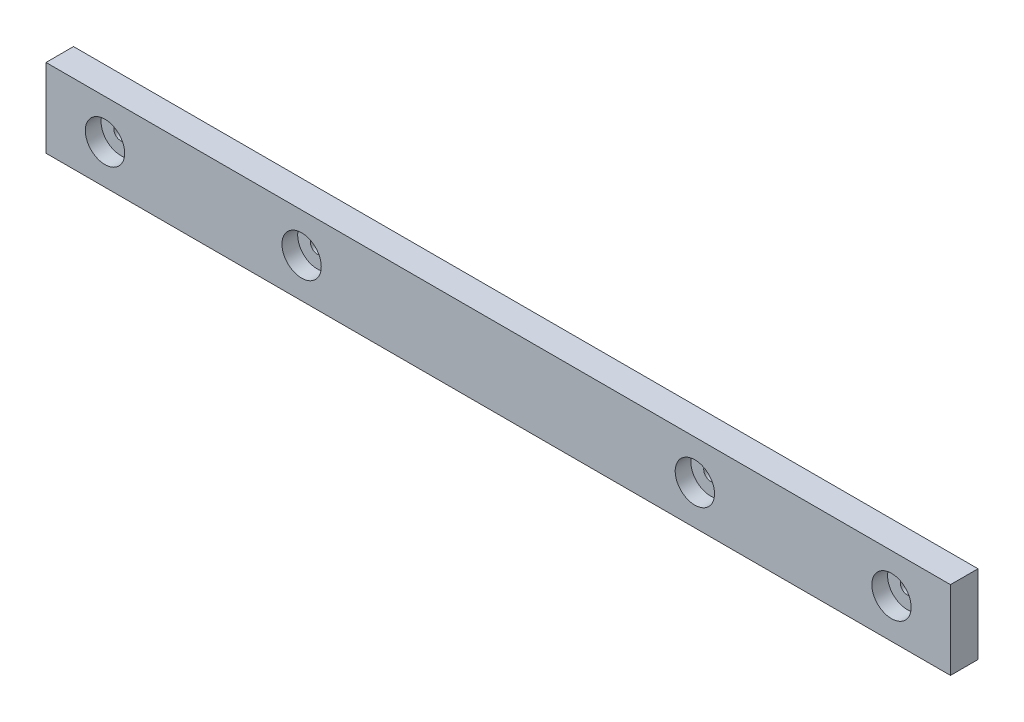
ISO-10303-21;
HEADER;
FILE_DESCRIPTION(('STEP AP214'),'2;1');
FILE_NAME('part.step','',(''),(''),'','','');
FILE_SCHEMA(('AUTOMOTIVE_DESIGN { 1 0 10303 214 1 1 1 1 }'));
ENDSEC;
DATA;
#1=APPLICATION_CONTEXT('core data for automotive mechanical design processes');
#2=APPLICATION_PROTOCOL_DEFINITION('international standard','automotive_design',2000,#1);
#3=PRODUCT_CONTEXT('',#1,'mechanical');
#4=PRODUCT('Part','Part','',(#3));
#5=PRODUCT_RELATED_PRODUCT_CATEGORY('part','',(#4));
#6=PRODUCT_DEFINITION_FORMATION('','',#4);
#7=PRODUCT_DEFINITION_CONTEXT('part definition',#1,'design');
#8=PRODUCT_DEFINITION('design','',#6,#7);
#9=PRODUCT_DEFINITION_SHAPE('','',#8);
#10=(LENGTH_UNIT() NAMED_UNIT(*) SI_UNIT(.MILLI.,.METRE.));
#11=(NAMED_UNIT(*) PLANE_ANGLE_UNIT() SI_UNIT($,.RADIAN.));
#12=(NAMED_UNIT(*) SI_UNIT($,.STERADIAN.) SOLID_ANGLE_UNIT());
#13=UNCERTAINTY_MEASURE_WITH_UNIT(LENGTH_MEASURE(1.E-05),#10,'distance_accuracy_value','');
#14=(GEOMETRIC_REPRESENTATION_CONTEXT(3) GLOBAL_UNCERTAINTY_ASSIGNED_CONTEXT((#13)) GLOBAL_UNIT_ASSIGNED_CONTEXT((#10,
#11,#12)) REPRESENTATION_CONTEXT('',''));
#15=CARTESIAN_POINT('',(0.,0.,0.));
#16=DIRECTION('',(0.,0.,1.));
#17=DIRECTION('',(1.,0.,0.));
#18=AXIS2_PLACEMENT_3D('',#15,#16,#17);
#19=CARTESIAN_POINT('',(-50.,0.,0.));
#20=DIRECTION('',(0.,0.,1.));
#21=DIRECTION('',(1.,0.,0.));
#22=AXIS2_PLACEMENT_3D('',#19,#20,#21);
#23=CYLINDRICAL_SURFACE('',#22,1.75);
#24=CARTESIAN_POINT('',(-50.,0.,0.));
#25=DIRECTION('',(0.,0.,1.));
#26=DIRECTION('',(1.,0.,0.));
#27=AXIS2_PLACEMENT_3D('',#24,#25,#26);
#28=CIRCLE('',#27,1.75);
#29=CARTESIAN_POINT('',(-48.25,0.,0.));
#30=VERTEX_POINT('',#29);
#31=EDGE_CURVE('E124',#30,#30,#28,.T.);
#32=ORIENTED_EDGE('',*,*,#31,.F.);
#33=EDGE_LOOP('',(#32));
#34=FACE_BOUND('',#33,.T.);
#35=CARTESIAN_POINT('',(-50.,0.,3.));
#36=DIRECTION('',(0.,0.,1.));
#37=DIRECTION('',(1.,0.,0.));
#38=AXIS2_PLACEMENT_3D('',#35,#36,#37);
#39=CIRCLE('',#38,1.75);
#40=CARTESIAN_POINT('',(-48.25,0.,3.));
#41=VERTEX_POINT('',#40);
#42=EDGE_CURVE('E41',#41,#41,#39,.F.);
#43=ORIENTED_EDGE('',*,*,#42,.F.);
#44=EDGE_LOOP('',(#43));
#45=FACE_BOUND('',#44,.T.);
#46=ADVANCED_FACE('F37',(#34,#45),#23,.F.);
#47=CARTESIAN_POINT('',(50.,0.,0.));
#48=DIRECTION('',(0.,0.,1.));
#49=DIRECTION('',(1.,0.,0.));
#50=AXIS2_PLACEMENT_3D('',#47,#48,#49);
#51=CYLINDRICAL_SURFACE('',#50,1.75);
#52=CARTESIAN_POINT('',(50.,0.,0.));
#53=DIRECTION('',(0.,0.,1.));
#54=DIRECTION('',(1.,0.,0.));
#55=AXIS2_PLACEMENT_3D('',#52,#53,#54);
#56=CIRCLE('',#55,1.75);
#57=CARTESIAN_POINT('',(51.75,0.,0.));
#58=VERTEX_POINT('',#57);
#59=EDGE_CURVE('E128',#58,#58,#56,.T.);
#60=ORIENTED_EDGE('',*,*,#59,.F.);
#61=EDGE_LOOP('',(#60));
#62=FACE_BOUND('',#61,.T.);
#63=CARTESIAN_POINT('',(50.,0.,3.));
#64=DIRECTION('',(0.,0.,1.));
#65=DIRECTION('',(1.,0.,0.));
#66=AXIS2_PLACEMENT_3D('',#63,#64,#65);
#67=CIRCLE('',#66,1.75);
#68=CARTESIAN_POINT('',(51.75,0.,3.));
#69=VERTEX_POINT('',#68);
#70=EDGE_CURVE('E119',#69,#69,#67,.F.);
#71=ORIENTED_EDGE('',*,*,#70,.F.);
#72=EDGE_LOOP('',(#71));
#73=FACE_BOUND('',#72,.T.);
#74=ADVANCED_FACE('F201',(#62,#73),#51,.F.);
#75=CARTESIAN_POINT('',(100.,0.,0.));
#76=DIRECTION('',(0.,0.,1.));
#77=DIRECTION('',(1.,0.,0.));
#78=AXIS2_PLACEMENT_3D('',#75,#76,#77);
#79=CYLINDRICAL_SURFACE('',#78,1.75);
#80=CARTESIAN_POINT('',(100.,0.,0.));
#81=DIRECTION('',(0.,0.,1.));
#82=DIRECTION('',(1.,0.,0.));
#83=AXIS2_PLACEMENT_3D('',#80,#81,#82);
#84=CIRCLE('',#83,1.75);
#85=CARTESIAN_POINT('',(101.75,0.,0.));
#86=VERTEX_POINT('',#85);
#87=EDGE_CURVE('E133',#86,#86,#84,.T.);
#88=ORIENTED_EDGE('',*,*,#87,.F.);
#89=EDGE_LOOP('',(#88));
#90=FACE_BOUND('',#89,.T.);
#91=CARTESIAN_POINT('',(100.,0.,3.));
#92=DIRECTION('',(0.,0.,1.));
#93=DIRECTION('',(1.,0.,0.));
#94=AXIS2_PLACEMENT_3D('',#91,#92,#93);
#95=CIRCLE('',#94,1.75);
#96=CARTESIAN_POINT('',(101.75,0.,3.));
#97=VERTEX_POINT('',#96);
#98=EDGE_CURVE('E116',#97,#97,#95,.F.);
#99=ORIENTED_EDGE('',*,*,#98,.F.);
#100=EDGE_LOOP('',(#99));
#101=FACE_BOUND('',#100,.T.);
#102=ADVANCED_FACE('F207',(#90,#101),#79,.F.);
#103=CARTESIAN_POINT('',(-100.,0.,0.));
#104=DIRECTION('',(0.,0.,1.));
#105=DIRECTION('',(1.,0.,0.));
#106=AXIS2_PLACEMENT_3D('',#103,#104,#105);
#107=CYLINDRICAL_SURFACE('',#106,1.75);
#108=CARTESIAN_POINT('',(-100.,0.,0.));
#109=DIRECTION('',(0.,0.,1.));
#110=DIRECTION('',(1.,0.,0.));
#111=AXIS2_PLACEMENT_3D('',#108,#109,#110);
#112=CIRCLE('',#111,1.75);
#113=CARTESIAN_POINT('',(-98.25,0.,0.));
#114=VERTEX_POINT('',#113);
#115=EDGE_CURVE('E107',#114,#114,#112,.T.);
#116=ORIENTED_EDGE('',*,*,#115,.F.);
#117=EDGE_LOOP('',(#116));
#118=FACE_BOUND('',#117,.T.);
#119=CARTESIAN_POINT('',(-100.,0.,3.));
#120=DIRECTION('',(0.,0.,1.));
#121=DIRECTION('',(1.,0.,0.));
#122=AXIS2_PLACEMENT_3D('',#119,#120,#121);
#123=CIRCLE('',#122,1.75);
#124=CARTESIAN_POINT('',(-98.25,0.,3.));
#125=VERTEX_POINT('',#124);
#126=EDGE_CURVE('E113',#125,#125,#123,.F.);
#127=ORIENTED_EDGE('',*,*,#126,.F.);
#128=EDGE_LOOP('',(#127));
#129=FACE_BOUND('',#128,.T.);
#130=ADVANCED_FACE('F223',(#118,#129),#107,.F.);
#131=CARTESIAN_POINT('',(115.,10.,7.));
#132=DIRECTION('',(-1.,0.,0.));
#133=DIRECTION('',(0.,-1.,0.));
#134=AXIS2_PLACEMENT_3D('',#131,#132,#133);
#135=PLANE('',#134);
#136=DIRECTION('',(0.,1.,0.));
#137=VECTOR('',#136,1.);
#138=CARTESIAN_POINT('',(115.,10.,0.));
#139=LINE('',#138,#137);
#140=CARTESIAN_POINT('',(115.,-10.,0.));
#141=VERTEX_POINT('',#140);
#142=CARTESIAN_POINT('',(115.,10.,0.));
#143=VERTEX_POINT('',#142);
#144=EDGE_CURVE('E104',#141,#143,#139,.T.);
#145=ORIENTED_EDGE('',*,*,#144,.T.);
#146=DIRECTION('',(0.,0.,-1.));
#147=VECTOR('',#146,1.);
#148=CARTESIAN_POINT('',(115.,10.,7.));
#149=LINE('',#148,#147);
#150=CARTESIAN_POINT('',(115.,10.,7.));
#151=VERTEX_POINT('',#150);
#152=EDGE_CURVE('E11',#151,#143,#149,.T.);
#153=ORIENTED_EDGE('',*,*,#152,.F.);
#154=DIRECTION('',(0.,1.,0.));
#155=VECTOR('',#154,1.);
#156=CARTESIAN_POINT('',(115.,10.,7.));
#157=LINE('',#156,#155);
#158=CARTESIAN_POINT('',(115.,-10.,7.));
#159=VERTEX_POINT('',#158);
#160=EDGE_CURVE('E91',#159,#151,#157,.T.);
#161=ORIENTED_EDGE('',*,*,#160,.F.);
#162=DIRECTION('',(0.,0.,-1.));
#163=VECTOR('',#162,1.);
#164=CARTESIAN_POINT('',(115.,-10.,7.));
#165=LINE('',#164,#163);
#166=EDGE_CURVE('E100',#159,#141,#165,.T.);
#167=ORIENTED_EDGE('',*,*,#166,.T.);
#168=EDGE_LOOP('',(#145,#153,#161,#167));
#169=FACE_BOUND('',#168,.T.);
#170=ADVANCED_FACE('F39',(#169),#135,.F.);
#171=CARTESIAN_POINT('',(-115.,10.,7.));
#172=DIRECTION('',(0.,-1.,0.));
#173=DIRECTION('',(0.,0.,-1.));
#174=AXIS2_PLACEMENT_3D('',#171,#172,#173);
#175=PLANE('',#174);
#176=DIRECTION('',(-1.,0.,0.));
#177=VECTOR('',#176,1.);
#178=CARTESIAN_POINT('',(-115.,10.,0.));
#179=LINE('',#178,#177);
#180=CARTESIAN_POINT('',(-115.,10.,0.));
#181=VERTEX_POINT('',#180);
#182=EDGE_CURVE('E95',#143,#181,#179,.T.);
#183=ORIENTED_EDGE('',*,*,#182,.T.);
#184=DIRECTION('',(0.,0.,-1.));
#185=VECTOR('',#184,1.);
#186=CARTESIAN_POINT('',(-115.,10.,7.));
#187=LINE('',#186,#185);
#188=CARTESIAN_POINT('',(-115.,10.,7.));
#189=VERTEX_POINT('',#188);
#190=EDGE_CURVE('E47',#189,#181,#187,.T.);
#191=ORIENTED_EDGE('',*,*,#190,.F.);
#192=DIRECTION('',(-1.,0.,0.));
#193=VECTOR('',#192,1.);
#194=CARTESIAN_POINT('',(-115.,10.,7.));
#195=LINE('',#194,#193);
#196=EDGE_CURVE('E86',#151,#189,#195,.T.);
#197=ORIENTED_EDGE('',*,*,#196,.F.);
#198=ORIENTED_EDGE('',*,*,#152,.T.);
#199=EDGE_LOOP('',(#183,#191,#197,#198));
#200=FACE_BOUND('',#199,.T.);
#201=ADVANCED_FACE('F94',(#200),#175,.F.);
#202=CARTESIAN_POINT('',(-115.,10.,7.));
#203=DIRECTION('',(1.,0.,0.));
#204=DIRECTION('',(0.,0.,-1.));
#205=AXIS2_PLACEMENT_3D('',#202,#203,#204);
#206=PLANE('',#205);
#207=DIRECTION('',(0.,-1.,0.));
#208=VECTOR('',#207,1.);
#209=CARTESIAN_POINT('',(-115.,10.,0.));
#210=LINE('',#209,#208);
#211=CARTESIAN_POINT('',(-115.,-10.,0.));
#212=VERTEX_POINT('',#211);
#213=EDGE_CURVE('E73',#181,#212,#210,.T.);
#214=ORIENTED_EDGE('',*,*,#213,.T.);
#215=DIRECTION('',(0.,0.,-1.));
#216=VECTOR('',#215,1.);
#217=CARTESIAN_POINT('',(-115.,-10.,7.));
#218=LINE('',#217,#216);
#219=CARTESIAN_POINT('',(-115.,-10.,7.));
#220=VERTEX_POINT('',#219);
#221=EDGE_CURVE('E96',#220,#212,#218,.T.);
#222=ORIENTED_EDGE('',*,*,#221,.F.);
#223=DIRECTION('',(0.,-1.,0.));
#224=VECTOR('',#223,1.);
#225=CARTESIAN_POINT('',(-115.,10.,7.));
#226=LINE('',#225,#224);
#227=EDGE_CURVE('E89',#189,#220,#226,.T.);
#228=ORIENTED_EDGE('',*,*,#227,.F.);
#229=ORIENTED_EDGE('',*,*,#190,.T.);
#230=EDGE_LOOP('',(#214,#222,#228,#229));
#231=FACE_BOUND('',#230,.T.);
#232=ADVANCED_FACE('F98',(#231),#206,.F.);
#233=CARTESIAN_POINT('',(-115.,-10.,7.));
#234=DIRECTION('',(0.,1.,0.));
#235=DIRECTION('',(0.,0.,1.));
#236=AXIS2_PLACEMENT_3D('',#233,#234,#235);
#237=PLANE('',#236);
#238=DIRECTION('',(1.,0.,0.));
#239=VECTOR('',#238,1.);
#240=CARTESIAN_POINT('',(-115.,-10.,0.));
#241=LINE('',#240,#239);
#242=EDGE_CURVE('E79',#212,#141,#241,.T.);
#243=ORIENTED_EDGE('',*,*,#242,.T.);
#244=ORIENTED_EDGE('',*,*,#166,.F.);
#245=DIRECTION('',(1.,0.,0.));
#246=VECTOR('',#245,1.);
#247=CARTESIAN_POINT('',(-115.,-10.,7.));
#248=LINE('',#247,#246);
#249=EDGE_CURVE('E56',#220,#159,#248,.T.);
#250=ORIENTED_EDGE('',*,*,#249,.F.);
#251=ORIENTED_EDGE('',*,*,#221,.T.);
#252=EDGE_LOOP('',(#243,#244,#250,#251));
#253=FACE_BOUND('',#252,.T.);
#254=ADVANCED_FACE('F177',(#253),#237,.F.);
#255=CARTESIAN_POINT('',(0.,0.,7.));
#256=DIRECTION('',(0.,0.,1.));
#257=DIRECTION('',(1.,0.,0.));
#258=AXIS2_PLACEMENT_3D('',#255,#256,#257);
#259=PLANE('',#258);
#260=CARTESIAN_POINT('',(-100.,0.,7.));
#261=DIRECTION('',(0.,0.,1.));
#262=DIRECTION('',(1.,0.,0.));
#263=AXIS2_PLACEMENT_3D('',#260,#261,#262);
#264=CIRCLE('',#263,5.);
#265=CARTESIAN_POINT('',(-95.,0.,7.));
#266=VERTEX_POINT('',#265);
#267=EDGE_CURVE('E158',#266,#266,#264,.T.);
#268=ORIENTED_EDGE('',*,*,#267,.F.);
#269=EDGE_LOOP('',(#268));
#270=FACE_BOUND('',#269,.T.);
#271=CARTESIAN_POINT('',(-50.,0.,7.));
#272=DIRECTION('',(0.,0.,1.));
#273=DIRECTION('',(1.,0.,0.));
#274=AXIS2_PLACEMENT_3D('',#271,#272,#273);
#275=CIRCLE('',#274,5.);
#276=CARTESIAN_POINT('',(-45.,0.,7.));
#277=VERTEX_POINT('',#276);
#278=EDGE_CURVE('E155',#277,#277,#275,.T.);
#279=ORIENTED_EDGE('',*,*,#278,.F.);
#280=EDGE_LOOP('',(#279));
#281=FACE_BOUND('',#280,.T.);
#282=CARTESIAN_POINT('',(50.,0.,7.));
#283=DIRECTION('',(0.,0.,1.));
#284=DIRECTION('',(1.,0.,0.));
#285=AXIS2_PLACEMENT_3D('',#282,#283,#284);
#286=CIRCLE('',#285,5.);
#287=CARTESIAN_POINT('',(55.,0.,7.));
#288=VERTEX_POINT('',#287);
#289=EDGE_CURVE('E149',#288,#288,#286,.T.);
#290=ORIENTED_EDGE('',*,*,#289,.F.);
#291=EDGE_LOOP('',(#290));
#292=FACE_BOUND('',#291,.T.);
#293=CARTESIAN_POINT('',(100.,0.,7.));
#294=DIRECTION('',(0.,0.,1.));
#295=DIRECTION('',(1.,0.,0.));
#296=AXIS2_PLACEMENT_3D('',#293,#294,#295);
#297=CIRCLE('',#296,5.);
#298=CARTESIAN_POINT('',(105.,0.,7.));
#299=VERTEX_POINT('',#298);
#300=EDGE_CURVE('E143',#299,#299,#297,.T.);
#301=ORIENTED_EDGE('',*,*,#300,.F.);
#302=EDGE_LOOP('',(#301));
#303=FACE_BOUND('',#302,.T.);
#304=ORIENTED_EDGE('',*,*,#160,.T.);
#305=ORIENTED_EDGE('',*,*,#196,.T.);
#306=ORIENTED_EDGE('',*,*,#227,.T.);
#307=ORIENTED_EDGE('',*,*,#249,.T.);
#308=EDGE_LOOP('',(#304,#305,#306,#307));
#309=FACE_BOUND('',#308,.T.);
#310=ADVANCED_FACE('F87',(#270,#281,#292,#303,#309),#259,.T.);
#311=CARTESIAN_POINT('',(0.,0.,0.));
#312=DIRECTION('',(0.,0.,1.));
#313=DIRECTION('',(1.,0.,0.));
#314=AXIS2_PLACEMENT_3D('',#311,#312,#313);
#315=PLANE('',#314);
#316=ORIENTED_EDGE('',*,*,#115,.T.);
#317=EDGE_LOOP('',(#316));
#318=FACE_BOUND('',#317,.T.);
#319=ORIENTED_EDGE('',*,*,#87,.T.);
#320=EDGE_LOOP('',(#319));
#321=FACE_BOUND('',#320,.T.);
#322=ORIENTED_EDGE('',*,*,#59,.T.);
#323=EDGE_LOOP('',(#322));
#324=FACE_BOUND('',#323,.T.);
#325=ORIENTED_EDGE('',*,*,#31,.T.);
#326=EDGE_LOOP('',(#325));
#327=FACE_BOUND('',#326,.T.);
#328=ORIENTED_EDGE('',*,*,#144,.F.);
#329=ORIENTED_EDGE('',*,*,#242,.F.);
#330=ORIENTED_EDGE('',*,*,#213,.F.);
#331=ORIENTED_EDGE('',*,*,#182,.F.);
#332=EDGE_LOOP('',(#328,#329,#330,#331));
#333=FACE_BOUND('',#332,.T.);
#334=ADVANCED_FACE('F176',(#318,#321,#324,#327,#333),#315,.F.);
#335=CARTESIAN_POINT('',(-100.,0.,3.));
#336=DIRECTION('',(0.,0.,1.));
#337=DIRECTION('',(1.,0.,0.));
#338=AXIS2_PLACEMENT_3D('',#335,#336,#337);
#339=PLANE('',#338);
#340=CARTESIAN_POINT('',(-100.,0.,3.));
#341=DIRECTION('',(0.,0.,1.));
#342=DIRECTION('',(1.,0.,0.));
#343=AXIS2_PLACEMENT_3D('',#340,#341,#342);
#344=CIRCLE('',#343,5.);
#345=CARTESIAN_POINT('',(-95.,0.,3.));
#346=VERTEX_POINT('',#345);
#347=EDGE_CURVE('E117',#346,#346,#344,.T.);
#348=ORIENTED_EDGE('',*,*,#347,.T.);
#349=EDGE_LOOP('',(#348));
#350=FACE_BOUND('',#349,.T.);
#351=ORIENTED_EDGE('',*,*,#126,.T.);
#352=EDGE_LOOP('',(#351));
#353=FACE_BOUND('',#352,.T.);
#354=ADVANCED_FACE('F164',(#350,#353),#339,.T.);
#355=CARTESIAN_POINT('',(-100.,0.,3.));
#356=DIRECTION('',(0.,0.,1.));
#357=DIRECTION('',(1.,0.,0.));
#358=AXIS2_PLACEMENT_3D('',#355,#356,#357);
#359=CYLINDRICAL_SURFACE('',#358,5.);
#360=ORIENTED_EDGE('',*,*,#347,.F.);
#361=EDGE_LOOP('',(#360));
#362=FACE_BOUND('',#361,.T.);
#363=ORIENTED_EDGE('',*,*,#267,.T.);
#364=EDGE_LOOP('',(#363));
#365=FACE_BOUND('',#364,.T.);
#366=ADVANCED_FACE('F167',(#362,#365),#359,.F.);
#367=CARTESIAN_POINT('',(100.,0.,3.));
#368=DIRECTION('',(0.,0.,1.));
#369=DIRECTION('',(1.,0.,0.));
#370=AXIS2_PLACEMENT_3D('',#367,#368,#369);
#371=PLANE('',#370);
#372=CARTESIAN_POINT('',(100.,0.,3.));
#373=DIRECTION('',(0.,0.,1.));
#374=DIRECTION('',(1.,0.,0.));
#375=AXIS2_PLACEMENT_3D('',#372,#373,#374);
#376=CIRCLE('',#375,5.);
#377=CARTESIAN_POINT('',(105.,0.,3.));
#378=VERTEX_POINT('',#377);
#379=EDGE_CURVE('E140',#378,#378,#376,.T.);
#380=ORIENTED_EDGE('',*,*,#379,.T.);
#381=EDGE_LOOP('',(#380));
#382=FACE_BOUND('',#381,.T.);
#383=ORIENTED_EDGE('',*,*,#98,.T.);
#384=EDGE_LOOP('',(#383));
#385=FACE_BOUND('',#384,.T.);
#386=ADVANCED_FACE('F170',(#382,#385),#371,.T.);
#387=CARTESIAN_POINT('',(100.,0.,3.));
#388=DIRECTION('',(0.,0.,1.));
#389=DIRECTION('',(1.,0.,0.));
#390=AXIS2_PLACEMENT_3D('',#387,#388,#389);
#391=CYLINDRICAL_SURFACE('',#390,5.);
#392=ORIENTED_EDGE('',*,*,#379,.F.);
#393=EDGE_LOOP('',(#392));
#394=FACE_BOUND('',#393,.T.);
#395=ORIENTED_EDGE('',*,*,#300,.T.);
#396=EDGE_LOOP('',(#395));
#397=FACE_BOUND('',#396,.T.);
#398=ADVANCED_FACE('F185',(#394,#397),#391,.F.);
#399=CARTESIAN_POINT('',(50.,0.,3.));
#400=DIRECTION('',(0.,0.,1.));
#401=DIRECTION('',(1.,0.,0.));
#402=AXIS2_PLACEMENT_3D('',#399,#400,#401);
#403=PLANE('',#402);
#404=CARTESIAN_POINT('',(50.,0.,3.));
#405=DIRECTION('',(0.,0.,1.));
#406=DIRECTION('',(1.,0.,0.));
#407=AXIS2_PLACEMENT_3D('',#404,#405,#406);
#408=CIRCLE('',#407,5.);
#409=CARTESIAN_POINT('',(55.,0.,3.));
#410=VERTEX_POINT('',#409);
#411=EDGE_CURVE('E146',#410,#410,#408,.T.);
#412=ORIENTED_EDGE('',*,*,#411,.T.);
#413=EDGE_LOOP('',(#412));
#414=FACE_BOUND('',#413,.T.);
#415=ORIENTED_EDGE('',*,*,#70,.T.);
#416=EDGE_LOOP('',(#415));
#417=FACE_BOUND('',#416,.T.);
#418=ADVANCED_FACE('F187',(#414,#417),#403,.T.);
#419=CARTESIAN_POINT('',(50.,0.,3.));
#420=DIRECTION('',(0.,0.,1.));
#421=DIRECTION('',(1.,0.,0.));
#422=AXIS2_PLACEMENT_3D('',#419,#420,#421);
#423=CYLINDRICAL_SURFACE('',#422,5.);
#424=ORIENTED_EDGE('',*,*,#411,.F.);
#425=EDGE_LOOP('',(#424));
#426=FACE_BOUND('',#425,.T.);
#427=ORIENTED_EDGE('',*,*,#289,.T.);
#428=EDGE_LOOP('',(#427));
#429=FACE_BOUND('',#428,.T.);
#430=ADVANCED_FACE('F194',(#426,#429),#423,.F.);
#431=CARTESIAN_POINT('',(-50.,0.,3.));
#432=DIRECTION('',(0.,0.,1.));
#433=DIRECTION('',(1.,0.,0.));
#434=AXIS2_PLACEMENT_3D('',#431,#432,#433);
#435=PLANE('',#434);
#436=CARTESIAN_POINT('',(-50.,0.,3.));
#437=DIRECTION('',(0.,0.,1.));
#438=DIRECTION('',(1.,0.,0.));
#439=AXIS2_PLACEMENT_3D('',#436,#437,#438);
#440=CIRCLE('',#439,5.);
#441=CARTESIAN_POINT('',(-45.,0.,3.));
#442=VERTEX_POINT('',#441);
#443=EDGE_CURVE('E152',#442,#442,#440,.T.);
#444=ORIENTED_EDGE('',*,*,#443,.T.);
#445=EDGE_LOOP('',(#444));
#446=FACE_BOUND('',#445,.T.);
#447=ORIENTED_EDGE('',*,*,#42,.T.);
#448=EDGE_LOOP('',(#447));
#449=FACE_BOUND('',#448,.T.);
#450=ADVANCED_FACE('F247',(#446,#449),#435,.T.);
#451=CARTESIAN_POINT('',(-50.,0.,3.));
#452=DIRECTION('',(0.,0.,1.));
#453=DIRECTION('',(1.,0.,0.));
#454=AXIS2_PLACEMENT_3D('',#451,#452,#453);
#455=CYLINDRICAL_SURFACE('',#454,5.);
#456=ORIENTED_EDGE('',*,*,#443,.F.);
#457=EDGE_LOOP('',(#456));
#458=FACE_BOUND('',#457,.T.);
#459=ORIENTED_EDGE('',*,*,#278,.T.);
#460=EDGE_LOOP('',(#459));
#461=FACE_BOUND('',#460,.T.);
#462=ADVANCED_FACE('F244',(#458,#461),#455,.F.);
#463=CLOSED_SHELL('',(#46,#74,#102,#130,#170,#201,#232,#254,#310,#334,#354,#366,#386,#398,#418,
#430,#450,#462));
#464=MANIFOLD_SOLID_BREP('B2',#463);
#465=ADVANCED_BREP_SHAPE_REPRESENTATION('',(#18,#464),#14);
#466=SHAPE_DEFINITION_REPRESENTATION(#9,#465);
ENDSEC;
END-ISO-10303-21;
